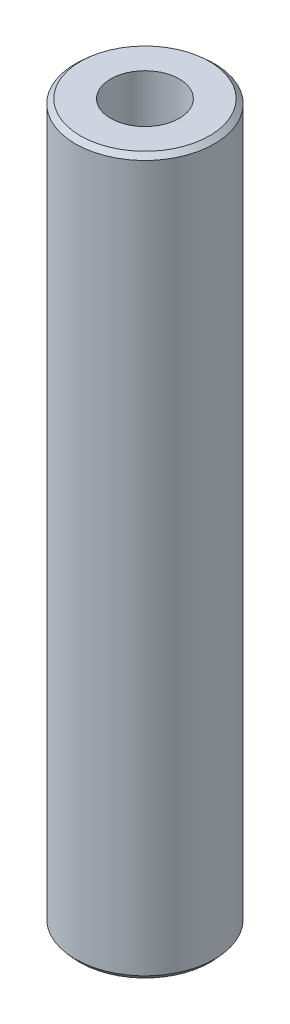
ISO-10303-21;
HEADER;
FILE_DESCRIPTION(('STEP AP214'),'2;1');
FILE_NAME('part.step','',(''),(''),'','','');
FILE_SCHEMA(('AUTOMOTIVE_DESIGN { 1 0 10303 214 1 1 1 1 }'));
ENDSEC;
DATA;
#1=APPLICATION_CONTEXT('core data for automotive mechanical design processes');
#2=APPLICATION_PROTOCOL_DEFINITION('international standard','automotive_design',2000,#1);
#3=PRODUCT_CONTEXT('',#1,'mechanical');
#4=PRODUCT('Part','Part','',(#3));
#5=PRODUCT_RELATED_PRODUCT_CATEGORY('part','',(#4));
#6=PRODUCT_DEFINITION_FORMATION('','',#4);
#7=PRODUCT_DEFINITION_CONTEXT('part definition',#1,'design');
#8=PRODUCT_DEFINITION('design','',#6,#7);
#9=PRODUCT_DEFINITION_SHAPE('','',#8);
#10=(LENGTH_UNIT() NAMED_UNIT(*) SI_UNIT(.MILLI.,.METRE.));
#11=(NAMED_UNIT(*) PLANE_ANGLE_UNIT() SI_UNIT($,.RADIAN.));
#12=(NAMED_UNIT(*) SI_UNIT($,.STERADIAN.) SOLID_ANGLE_UNIT());
#13=UNCERTAINTY_MEASURE_WITH_UNIT(LENGTH_MEASURE(1.E-05),#10,'distance_accuracy_value','');
#14=(GEOMETRIC_REPRESENTATION_CONTEXT(3) GLOBAL_UNCERTAINTY_ASSIGNED_CONTEXT((#13)) GLOBAL_UNIT_ASSIGNED_CONTEXT((#10,
#11,#12)) REPRESENTATION_CONTEXT('',''));
#15=CARTESIAN_POINT('',(0.,0.,0.));
#16=DIRECTION('',(0.,0.,1.));
#17=DIRECTION('',(1.,0.,0.));
#18=AXIS2_PLACEMENT_3D('',#15,#16,#17);
#19=CARTESIAN_POINT('',(0.,386.096508248404,0.));
#20=DIRECTION('',(0.,-1.,0.));
#21=DIRECTION('',(0.,0.,-1.));
#22=AXIS2_PLACEMENT_3D('',#19,#20,#21);
#23=CYLINDRICAL_SURFACE('',#22,37.5);
#24=CARTESIAN_POINT('',(0.,383.70805208351,0.));
#25=DIRECTION('',(0.,1.,0.));
#26=DIRECTION('',(0.,0.,1.));
#27=AXIS2_PLACEMENT_3D('',#24,#25,#26);
#28=CIRCLE('',#27,37.5);
#29=CARTESIAN_POINT('',(0.,383.70805208351,37.5));
#30=VERTEX_POINT('',#29);
#31=EDGE_CURVE('E50',#30,#30,#28,.F.);
#32=ORIENTED_EDGE('',*,*,#31,.T.);
#33=EDGE_LOOP('',(#32));
#34=FACE_BOUND('',#33,.T.);
#35=CARTESIAN_POINT('',(0.,2.70151337430918,0.));
#36=DIRECTION('',(0.,1.,0.));
#37=DIRECTION('',(0.,0.,1.));
#38=AXIS2_PLACEMENT_3D('',#35,#36,#37);
#39=CIRCLE('',#38,37.5);
#40=CARTESIAN_POINT('',(0.,2.70151337430918,37.5));
#41=VERTEX_POINT('',#40);
#42=EDGE_CURVE('E51',#41,#41,#39,.T.);
#43=ORIENTED_EDGE('',*,*,#42,.T.);
#44=EDGE_LOOP('',(#43));
#45=FACE_BOUND('',#44,.T.);
#46=ADVANCED_FACE('F39',(#34,#45),#23,.T.);
#47=CARTESIAN_POINT('',(0.,386.096508248404,0.));
#48=DIRECTION('',(0.,1.,0.));
#49=DIRECTION('',(0.,0.,1.));
#50=AXIS2_PLACEMENT_3D('',#47,#48,#49);
#51=PLANE('',#50);
#52=CARTESIAN_POINT('',(0.,386.096508248404,0.));
#53=DIRECTION('',(0.,1.,0.));
#54=DIRECTION('',(0.,0.,1.));
#55=AXIS2_PLACEMENT_3D('',#52,#53,#54);
#56=CIRCLE('',#55,34.7984866256907);
#57=CARTESIAN_POINT('',(0.,386.096508248404,34.7984866256907));
#58=VERTEX_POINT('',#57);
#59=EDGE_CURVE('E54',#58,#58,#56,.T.);
#60=ORIENTED_EDGE('',*,*,#59,.T.);
#61=EDGE_LOOP('',(#60));
#62=FACE_BOUND('',#61,.T.);
#63=CARTESIAN_POINT('',(0.,386.096508248404,0.));
#64=DIRECTION('',(0.,1.,0.));
#65=DIRECTION('',(0.,0.,1.));
#66=AXIS2_PLACEMENT_3D('',#63,#64,#65);
#67=CIRCLE('',#66,18.4798706954289);
#68=CARTESIAN_POINT('',(0.,386.096508248404,18.4798706954289));
#69=VERTEX_POINT('',#68);
#70=EDGE_CURVE('E58',#69,#69,#67,.T.);
#71=ORIENTED_EDGE('',*,*,#70,.F.);
#72=EDGE_LOOP('',(#71));
#73=FACE_BOUND('',#72,.T.);
#74=ADVANCED_FACE('F69',(#62,#73),#51,.T.);
#75=CARTESIAN_POINT('',(0.,0.,0.));
#76=DIRECTION('',(0.,1.,0.));
#77=DIRECTION('',(0.,0.,1.));
#78=AXIS2_PLACEMENT_3D('',#75,#76,#77);
#79=PLANE('',#78);
#80=CARTESIAN_POINT('',(0.,0.,0.));
#81=DIRECTION('',(0.,1.,0.));
#82=DIRECTION('',(0.,0.,1.));
#83=AXIS2_PLACEMENT_3D('',#80,#81,#82);
#84=CIRCLE('',#83,35.1115438351065);
#85=CARTESIAN_POINT('',(0.,0.,35.1115438351065));
#86=VERTEX_POINT('',#85);
#87=EDGE_CURVE('E10',#86,#86,#84,.F.);
#88=ORIENTED_EDGE('',*,*,#87,.T.);
#89=EDGE_LOOP('',(#88));
#90=FACE_BOUND('',#89,.T.);
#91=CARTESIAN_POINT('',(0.,0.,0.));
#92=DIRECTION('',(0.,1.,0.));
#93=DIRECTION('',(0.,0.,1.));
#94=AXIS2_PLACEMENT_3D('',#91,#92,#93);
#95=CIRCLE('',#94,18.4798706954289);
#96=CARTESIAN_POINT('',(0.,0.,18.4798706954289));
#97=VERTEX_POINT('',#96);
#98=EDGE_CURVE('E63',#97,#97,#95,.T.);
#99=ORIENTED_EDGE('',*,*,#98,.T.);
#100=EDGE_LOOP('',(#99));
#101=FACE_BOUND('',#100,.T.);
#102=ADVANCED_FACE('F75',(#90,#101),#79,.F.);
#103=CARTESIAN_POINT('',(0.,386.096508248404,0.));
#104=DIRECTION('',(0.,-1.,0.));
#105=DIRECTION('',(0.,0.,-1.));
#106=AXIS2_PLACEMENT_3D('',#103,#104,#105);
#107=CYLINDRICAL_SURFACE('',#106,18.4798706954289);
#108=ORIENTED_EDGE('',*,*,#70,.T.);
#109=EDGE_LOOP('',(#108));
#110=FACE_BOUND('',#109,.T.);
#111=ORIENTED_EDGE('',*,*,#98,.F.);
#112=EDGE_LOOP('',(#111));
#113=FACE_BOUND('',#112,.T.);
#114=ADVANCED_FACE('F70',(#110,#113),#107,.F.);
#115=CARTESIAN_POINT('',(0.,386.096508248404,0.));
#116=DIRECTION('',(0.,-1.,0.));
#117=DIRECTION('',(0.,0.,-1.));
#118=AXIS2_PLACEMENT_3D('',#115,#116,#117);
#119=CONICAL_SURFACE('',#118,34.7984866256907,0.846825516340084);
#120=ORIENTED_EDGE('',*,*,#31,.F.);
#121=EDGE_LOOP('',(#120));
#122=FACE_BOUND('',#121,.T.);
#123=ORIENTED_EDGE('',*,*,#59,.F.);
#124=EDGE_LOOP('',(#123));
#125=FACE_BOUND('',#124,.T.);
#126=ADVANCED_FACE('F81',(#122,#125),#119,.T.);
#127=CARTESIAN_POINT('',(0.,2.70151337430918,0.));
#128=DIRECTION('',(0.,1.,0.));
#129=DIRECTION('',(0.,0.,1.));
#130=AXIS2_PLACEMENT_3D('',#127,#128,#129);
#131=CONICAL_SURFACE('',#130,37.5,0.723970810454826);
#132=ORIENTED_EDGE('',*,*,#87,.F.);
#133=EDGE_LOOP('',(#132));
#134=FACE_BOUND('',#133,.T.);
#135=ORIENTED_EDGE('',*,*,#42,.F.);
#136=EDGE_LOOP('',(#135));
#137=FACE_BOUND('',#136,.T.);
#138=ADVANCED_FACE('F45',(#134,#137),#131,.T.);
#139=CLOSED_SHELL('',(#46,#74,#102,#114,#126,#138));
#140=MANIFOLD_SOLID_BREP('B2',#139);
#141=ADVANCED_BREP_SHAPE_REPRESENTATION('',(#18,#140),#14);
#142=SHAPE_DEFINITION_REPRESENTATION(#9,#141);
ENDSEC;
END-ISO-10303-21;
